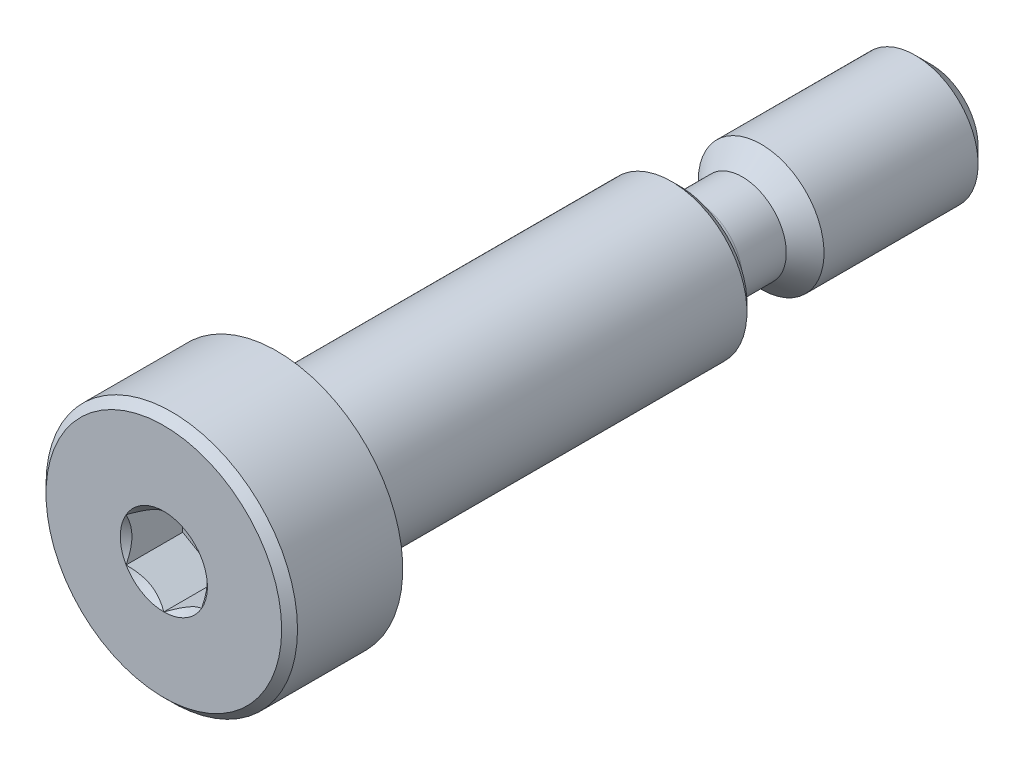
ISO-10303-21;
HEADER;
FILE_DESCRIPTION(('STEP AP214'),'2;1');
FILE_NAME('part.step','',(''),(''),'','','');
FILE_SCHEMA(('AUTOMOTIVE_DESIGN { 1 0 10303 214 1 1 1 1 }'));
ENDSEC;
DATA;
#1=APPLICATION_CONTEXT('core data for automotive mechanical design processes');
#2=APPLICATION_PROTOCOL_DEFINITION('international standard','automotive_design',2000,#1);
#3=PRODUCT_CONTEXT('',#1,'mechanical');
#4=PRODUCT('Part','Part','',(#3));
#5=PRODUCT_RELATED_PRODUCT_CATEGORY('part','',(#4));
#6=PRODUCT_DEFINITION_FORMATION('','',#4);
#7=PRODUCT_DEFINITION_CONTEXT('part definition',#1,'design');
#8=PRODUCT_DEFINITION('design','',#6,#7);
#9=PRODUCT_DEFINITION_SHAPE('','',#8);
#10=(LENGTH_UNIT() NAMED_UNIT(*) SI_UNIT(.MILLI.,.METRE.));
#11=(NAMED_UNIT(*) PLANE_ANGLE_UNIT() SI_UNIT($,.RADIAN.));
#12=(NAMED_UNIT(*) SI_UNIT($,.STERADIAN.) SOLID_ANGLE_UNIT());
#13=UNCERTAINTY_MEASURE_WITH_UNIT(LENGTH_MEASURE(1.E-05),#10,'distance_accuracy_value','');
#14=(GEOMETRIC_REPRESENTATION_CONTEXT(3) GLOBAL_UNCERTAINTY_ASSIGNED_CONTEXT((#13)) GLOBAL_UNIT_ASSIGNED_CONTEXT((#10,
#11,#12)) REPRESENTATION_CONTEXT('',''));
#15=CARTESIAN_POINT('',(0.,0.,0.));
#16=DIRECTION('',(0.,0.,1.));
#17=DIRECTION('',(1.,0.,0.));
#18=AXIS2_PLACEMENT_3D('',#15,#16,#17);
#19=CARTESIAN_POINT('',(0.,0.,0.));
#20=DIRECTION('',(0.,0.,1.));
#21=DIRECTION('',(1.,0.,0.));
#22=AXIS2_PLACEMENT_3D('',#19,#20,#21);
#23=PLANE('',#22);
#24=CARTESIAN_POINT('',(0.,0.,0.));
#25=DIRECTION('',(0.,0.,1.));
#26=DIRECTION('',(1.,0.,0.));
#27=AXIS2_PLACEMENT_3D('',#24,#25,#26);
#28=CIRCLE('',#27,1.73205080756888);
#29=CARTESIAN_POINT('',(1.5,0.866025403784439,0.));
#30=VERTEX_POINT('',#29);
#31=CARTESIAN_POINT('',(0.,1.73205080756888,0.));
#32=VERTEX_POINT('',#31);
#33=EDGE_CURVE('E105',#30,#32,#28,.T.);
#34=ORIENTED_EDGE('',*,*,#33,.F.);
#35=CARTESIAN_POINT('',(1.5,-0.866025403784438,0.));
#36=VERTEX_POINT('',#35);
#37=EDGE_CURVE('E94',#36,#30,#28,.T.);
#38=ORIENTED_EDGE('',*,*,#37,.F.);
#39=CARTESIAN_POINT('',(0.,-1.73205080756888,0.));
#40=VERTEX_POINT('',#39);
#41=EDGE_CURVE('E103',#40,#36,#28,.T.);
#42=ORIENTED_EDGE('',*,*,#41,.F.);
#43=CARTESIAN_POINT('',(-1.5,-0.86602540378444,0.));
#44=VERTEX_POINT('',#43);
#45=EDGE_CURVE('E54',#44,#40,#28,.T.);
#46=ORIENTED_EDGE('',*,*,#45,.F.);
#47=CARTESIAN_POINT('',(-1.5,0.86602540378444,0.));
#48=VERTEX_POINT('',#47);
#49=EDGE_CURVE('E61',#48,#44,#28,.T.);
#50=ORIENTED_EDGE('',*,*,#49,.F.);
#51=EDGE_CURVE('E131',#32,#48,#28,.T.);
#52=ORIENTED_EDGE('',*,*,#51,.F.);
#53=EDGE_LOOP('',(#34,#38,#42,#46,#50,#52));
#54=FACE_BOUND('',#53,.T.);
#55=CARTESIAN_POINT('',(0.,0.,0.));
#56=DIRECTION('',(0.,0.,1.));
#57=DIRECTION('',(1.,0.,0.));
#58=AXIS2_PLACEMENT_3D('',#55,#56,#57);
#59=CIRCLE('',#58,4.68499999999999);
#60=CARTESIAN_POINT('',(4.68499999999999,0.,0.));
#61=VERTEX_POINT('',#60);
#62=EDGE_CURVE('E48',#61,#61,#59,.T.);
#63=ORIENTED_EDGE('',*,*,#62,.T.);
#64=EDGE_LOOP('',(#63));
#65=FACE_BOUND('',#64,.T.);
#66=ADVANCED_FACE('F34',(#54,#65),#23,.T.);
#67=CARTESIAN_POINT('',(0.,0.,-30.5));
#68=DIRECTION('',(0.,0.,-1.));
#69=DIRECTION('',(-1.,0.,0.));
#70=AXIS2_PLACEMENT_3D('',#67,#68,#69);
#71=CYLINDRICAL_SURFACE('',#70,4.99999999999999);
#72=CARTESIAN_POINT('',(0.,0.,-0.315000000000003));
#73=DIRECTION('',(0.,0.,1.));
#74=DIRECTION('',(1.,0.,0.));
#75=AXIS2_PLACEMENT_3D('',#72,#73,#74);
#76=CIRCLE('',#75,4.99999999999999);
#77=CARTESIAN_POINT('',(4.99999999999999,0.,-0.315000000000003));
#78=VERTEX_POINT('',#77);
#79=EDGE_CURVE('E227',#78,#78,#76,.F.);
#80=ORIENTED_EDGE('',*,*,#79,.T.);
#81=EDGE_LOOP('',(#80));
#82=FACE_BOUND('',#81,.T.);
#83=CARTESIAN_POINT('',(0.,0.,-4.5));
#84=DIRECTION('',(0.,0.,-1.));
#85=DIRECTION('',(-1.,0.,0.));
#86=AXIS2_PLACEMENT_3D('',#83,#84,#85);
#87=CIRCLE('',#86,4.99999999999999);
#88=CARTESIAN_POINT('',(-4.99999999999999,0.,-4.5));
#89=VERTEX_POINT('',#88);
#90=EDGE_CURVE('E242',#89,#89,#87,.T.);
#91=ORIENTED_EDGE('',*,*,#90,.F.);
#92=EDGE_LOOP('',(#91));
#93=FACE_BOUND('',#92,.T.);
#94=ADVANCED_FACE('F196',(#82,#93),#71,.T.);
#95=CARTESIAN_POINT('',(0.,-4.99999999999999,-4.5));
#96=DIRECTION('',(0.,0.,-1.));
#97=DIRECTION('',(-1.,0.,0.));
#98=AXIS2_PLACEMENT_3D('',#95,#96,#97);
#99=PLANE('',#98);
#100=ORIENTED_EDGE('',*,*,#90,.T.);
#101=EDGE_LOOP('',(#100));
#102=FACE_BOUND('',#101,.T.);
#103=CARTESIAN_POINT('',(0.,0.,-4.5));
#104=DIRECTION('',(0.,0.,-1.));
#105=DIRECTION('',(-1.,0.,0.));
#106=AXIS2_PLACEMENT_3D('',#103,#104,#105);
#107=CIRCLE('',#106,3.);
#108=CARTESIAN_POINT('',(-3.,0.,-4.5));
#109=VERTEX_POINT('',#108);
#110=EDGE_CURVE('E244',#109,#109,#107,.T.);
#111=ORIENTED_EDGE('',*,*,#110,.F.);
#112=EDGE_LOOP('',(#111));
#113=FACE_BOUND('',#112,.T.);
#114=ADVANCED_FACE('F201',(#102,#113),#99,.T.);
#115=CARTESIAN_POINT('',(0.,0.,-30.5));
#116=DIRECTION('',(0.,0.,-1.));
#117=DIRECTION('',(-1.,0.,0.));
#118=AXIS2_PLACEMENT_3D('',#115,#116,#117);
#119=CYLINDRICAL_SURFACE('',#118,3.);
#120=CARTESIAN_POINT('',(0.,0.,-20.185));
#121=DIRECTION('',(0.,0.,-1.));
#122=DIRECTION('',(-1.,0.,0.));
#123=AXIS2_PLACEMENT_3D('',#120,#121,#122);
#124=CIRCLE('',#123,3.);
#125=CARTESIAN_POINT('',(-3.,0.,-20.185));
#126=VERTEX_POINT('',#125);
#127=EDGE_CURVE('E220',#126,#126,#124,.F.);
#128=ORIENTED_EDGE('',*,*,#127,.T.);
#129=EDGE_LOOP('',(#128));
#130=FACE_BOUND('',#129,.T.);
#131=ORIENTED_EDGE('',*,*,#110,.T.);
#132=EDGE_LOOP('',(#131));
#133=FACE_BOUND('',#132,.T.);
#134=ADVANCED_FACE('F344',(#130,#133),#119,.T.);
#135=CARTESIAN_POINT('',(0.,-3.,-20.5));
#136=DIRECTION('',(0.,0.,-1.));
#137=DIRECTION('',(-1.,0.,0.));
#138=AXIS2_PLACEMENT_3D('',#135,#136,#137);
#139=PLANE('',#138);
#140=CARTESIAN_POINT('',(0.,0.,-20.5));
#141=DIRECTION('',(0.,0.,-1.));
#142=DIRECTION('',(-1.,0.,0.));
#143=AXIS2_PLACEMENT_3D('',#140,#141,#142);
#144=CIRCLE('',#143,2.68499999999999);
#145=CARTESIAN_POINT('',(-2.68499999999999,0.,-20.5));
#146=VERTEX_POINT('',#145);
#147=EDGE_CURVE('E223',#146,#146,#144,.T.);
#148=ORIENTED_EDGE('',*,*,#147,.T.);
#149=EDGE_LOOP('',(#148));
#150=FACE_BOUND('',#149,.T.);
#151=CARTESIAN_POINT('',(0.,0.,-20.5));
#152=DIRECTION('',(0.,0.,-1.));
#153=DIRECTION('',(-1.,0.,0.));
#154=AXIS2_PLACEMENT_3D('',#151,#152,#153);
#155=CIRCLE('',#154,2.5);
#156=CARTESIAN_POINT('',(-2.5,0.,-20.5));
#157=VERTEX_POINT('',#156);
#158=EDGE_CURVE('E253',#157,#157,#155,.T.);
#159=ORIENTED_EDGE('',*,*,#158,.F.);
#160=EDGE_LOOP('',(#159));
#161=FACE_BOUND('',#160,.T.);
#162=ADVANCED_FACE('F351',(#150,#161),#139,.T.);
#163=CARTESIAN_POINT('',(0.,0.,-21.2500000075));
#164=DIRECTION('',(0.,0.,-1.));
#165=DIRECTION('',(-1.,0.,0.));
#166=AXIS2_PLACEMENT_3D('',#163,#164,#165);
#167=TOROIDAL_SURFACE('',#166,2.5,0.750000007499999);
#168=CARTESIAN_POINT('',(0.,0.,-21.2500000075));
#169=DIRECTION('',(0.,0.,-1.));
#170=DIRECTION('',(-1.,0.,0.));
#171=AXIS2_PLACEMENT_3D('',#168,#169,#170);
#172=CIRCLE('',#171,1.7499999925);
#173=CARTESIAN_POINT('',(-1.7499999925,0.,-21.2500000075));
#174=VERTEX_POINT('',#173);
#175=EDGE_CURVE('E257',#174,#174,#172,.T.);
#176=ORIENTED_EDGE('',*,*,#175,.F.);
#177=EDGE_LOOP('',(#176));
#178=FACE_BOUND('',#177,.T.);
#179=ORIENTED_EDGE('',*,*,#158,.T.);
#180=EDGE_LOOP('',(#179));
#181=FACE_BOUND('',#180,.T.);
#182=ADVANCED_FACE('F359',(#178,#181),#167,.F.);
#183=CARTESIAN_POINT('',(0.,0.,-30.5));
#184=DIRECTION('',(0.,0.,-1.));
#185=DIRECTION('',(-1.,0.,0.));
#186=AXIS2_PLACEMENT_3D('',#183,#184,#185);
#187=CYLINDRICAL_SURFACE('',#186,1.7499999925);
#188=CARTESIAN_POINT('',(0.,0.,-23.));
#189=DIRECTION('',(0.,0.,-1.));
#190=DIRECTION('',(-1.,0.,0.));
#191=AXIS2_PLACEMENT_3D('',#188,#189,#190);
#192=CIRCLE('',#191,1.7499999925);
#193=CARTESIAN_POINT('',(-1.7499999925,0.,-23.));
#194=VERTEX_POINT('',#193);
#195=EDGE_CURVE('E261',#194,#194,#192,.T.);
#196=ORIENTED_EDGE('',*,*,#195,.F.);
#197=EDGE_LOOP('',(#196));
#198=FACE_BOUND('',#197,.T.);
#199=ORIENTED_EDGE('',*,*,#175,.T.);
#200=EDGE_LOOP('',(#199));
#201=FACE_BOUND('',#200,.T.);
#202=ADVANCED_FACE('F385',(#198,#201),#187,.T.);
#203=CARTESIAN_POINT('',(0.,0.,-23.));
#204=DIRECTION('',(0.,0.,-1.));
#205=DIRECTION('',(-1.,0.,0.));
#206=AXIS2_PLACEMENT_3D('',#203,#204,#205);
#207=CONICAL_SURFACE('',#206,1.7499999925,0.785398163397444);
#208=CARTESIAN_POINT('',(0.,0.,-23.7500000075));
#209=DIRECTION('',(0.,0.,-1.));
#210=DIRECTION('',(-1.,0.,0.));
#211=AXIS2_PLACEMENT_3D('',#208,#209,#210);
#212=CIRCLE('',#211,2.5);
#213=CARTESIAN_POINT('',(-2.5,0.,-23.7500000075));
#214=VERTEX_POINT('',#213);
#215=EDGE_CURVE('E248',#214,#214,#212,.F.);
#216=ORIENTED_EDGE('',*,*,#215,.T.);
#217=EDGE_LOOP('',(#216));
#218=FACE_BOUND('',#217,.T.);
#219=ORIENTED_EDGE('',*,*,#195,.T.);
#220=EDGE_LOOP('',(#219));
#221=FACE_BOUND('',#220,.T.);
#222=ADVANCED_FACE('F376',(#218,#221),#207,.T.);
#223=CARTESIAN_POINT('',(0.,-2.5,-30.5));
#224=DIRECTION('',(0.,0.,-1.));
#225=DIRECTION('',(-1.,0.,0.));
#226=AXIS2_PLACEMENT_3D('',#223,#224,#225);
#227=PLANE('',#226);
#228=CARTESIAN_POINT('',(0.,0.,-30.5));
#229=DIRECTION('',(0.,0.,-1.));
#230=DIRECTION('',(-1.,0.,0.));
#231=AXIS2_PLACEMENT_3D('',#228,#229,#230);
#232=CIRCLE('',#231,1.875);
#233=CARTESIAN_POINT('',(-1.875,0.,-30.5));
#234=VERTEX_POINT('',#233);
#235=EDGE_CURVE('E230',#234,#234,#232,.T.);
#236=ORIENTED_EDGE('',*,*,#235,.T.);
#237=EDGE_LOOP('',(#236));
#238=FACE_BOUND('',#237,.T.);
#239=ADVANCED_FACE('F367',(#238),#227,.T.);
#240=CARTESIAN_POINT('',(0.,0.,-30.5));
#241=DIRECTION('',(0.,0.,-1.));
#242=DIRECTION('',(-1.,0.,0.));
#243=AXIS2_PLACEMENT_3D('',#240,#241,#242);
#244=CYLINDRICAL_SURFACE('',#243,2.5);
#245=CARTESIAN_POINT('',(0.,0.,-29.875));
#246=DIRECTION('',(0.,0.,-1.));
#247=DIRECTION('',(-1.,0.,0.));
#248=AXIS2_PLACEMENT_3D('',#245,#246,#247);
#249=CIRCLE('',#248,2.5);
#250=CARTESIAN_POINT('',(-2.5,0.,-29.875));
#251=VERTEX_POINT('',#250);
#252=EDGE_CURVE('E225',#251,#251,#249,.F.);
#253=ORIENTED_EDGE('',*,*,#252,.T.);
#254=EDGE_LOOP('',(#253));
#255=FACE_BOUND('',#254,.T.);
#256=ORIENTED_EDGE('',*,*,#215,.F.);
#257=EDGE_LOOP('',(#256));
#258=FACE_BOUND('',#257,.T.);
#259=ADVANCED_FACE('F209',(#255,#258),#244,.T.);
#260=CARTESIAN_POINT('',(0.,0.,-30.5));
#261=DIRECTION('',(0.,0.,1.));
#262=DIRECTION('',(1.,0.,0.));
#263=AXIS2_PLACEMENT_3D('',#260,#261,#262);
#264=CONICAL_SURFACE('',#263,1.875,0.785398163397453);
#265=ORIENTED_EDGE('',*,*,#252,.F.);
#266=EDGE_LOOP('',(#265));
#267=FACE_BOUND('',#266,.T.);
#268=ORIENTED_EDGE('',*,*,#235,.F.);
#269=EDGE_LOOP('',(#268));
#270=FACE_BOUND('',#269,.T.);
#271=ADVANCED_FACE('F206',(#267,#270),#264,.T.);
#272=CARTESIAN_POINT('',(0.,0.,-20.5));
#273=DIRECTION('',(0.,0.,1.));
#274=DIRECTION('',(1.,0.,0.));
#275=AXIS2_PLACEMENT_3D('',#272,#273,#274);
#276=CONICAL_SURFACE('',#275,2.68499999999999,0.785398163397452);
#277=ORIENTED_EDGE('',*,*,#127,.F.);
#278=EDGE_LOOP('',(#277));
#279=FACE_BOUND('',#278,.T.);
#280=ORIENTED_EDGE('',*,*,#147,.F.);
#281=EDGE_LOOP('',(#280));
#282=FACE_BOUND('',#281,.T.);
#283=ADVANCED_FACE('F208',(#279,#282),#276,.T.);
#284=CARTESIAN_POINT('',(0.,0.,-0.315000000000003));
#285=DIRECTION('',(0.,0.,-1.));
#286=DIRECTION('',(-1.,0.,0.));
#287=AXIS2_PLACEMENT_3D('',#284,#285,#286);
#288=CONICAL_SURFACE('',#287,4.99999999999999,0.785398163397451);
#289=ORIENTED_EDGE('',*,*,#62,.F.);
#290=EDGE_LOOP('',(#289));
#291=FACE_BOUND('',#290,.T.);
#292=ORIENTED_EDGE('',*,*,#79,.F.);
#293=EDGE_LOOP('',(#292));
#294=FACE_BOUND('',#293,.T.);
#295=ADVANCED_FACE('F36',(#291,#294),#288,.T.);
#296=CARTESIAN_POINT('',(0.,0.,0.));
#297=DIRECTION('',(0.,0.,1.));
#298=DIRECTION('',(1.,0.,0.));
#299=AXIS2_PLACEMENT_3D('',#296,#297,#298);
#300=CONICAL_SURFACE('',#299,1.73205080756888,0.78539816339745);
#301=ORIENTED_EDGE('',*,*,#33,.T.);
#302=CARTESIAN_POINT('',(1.5002,0.865909933730602,0.000115481600072925));
#303=CARTESIAN_POINT('',(1.44863220926292,0.895682611594167,-0.0296345239326727));
#304=CARTESIAN_POINT('',(1.3962020823348,0.925953159489766,-0.0576375160896877));
#305=CARTESIAN_POINT('',(1.2892909659444,0.987678321317124,-0.108910769559858));
#306=CARTESIAN_POINT('',(1.23479980418534,1.01913880822718,-0.132152494955627));
#307=CARTESIAN_POINT('',(1.12492091864275,1.08257741237344,-0.17196627100778));
#308=CARTESIAN_POINT('',(1.0695611909048,1.11453936608521,-0.188638414329104));
#309=CARTESIAN_POINT('',(0.95762274252285,1.1791670593912,-0.214325543181897));
#310=CARTESIAN_POINT('',(0.901047443446992,1.21183082354213,-0.223359709521134));
#311=CARTESIAN_POINT('',(0.80354461048356,1.26812411040032,-0.231510918773148));
#312=CARTESIAN_POINT('',(0.762743091719534,1.29168087824208,-0.232717747010783));
#313=CARTESIAN_POINT('',(0.681212030384142,1.33875285845138,-0.230685942837733));
#314=CARTESIAN_POINT('',(0.64048250568537,1.36226806050018,-0.227446329251692));
#315=CARTESIAN_POINT('',(0.559415597836584,1.40907206156905,-0.216708014018038));
#316=CARTESIAN_POINT('',(0.519078615401712,1.43236062923612,-0.209205346981267));
#317=CARTESIAN_POINT('',(0.43908166308597,1.47854689118997,-0.19034838807171));
#318=CARTESIAN_POINT('',(0.399421991483792,1.50144441326545,-0.178992442981415));
#319=CARTESIAN_POINT('',(0.297836865225515,1.56009461325633,-0.145278352407328));
#320=CARTESIAN_POINT('',(0.236541446290311,1.59548353987866,-0.120378150906633));
#321=CARTESIAN_POINT('',(0.146414371536687,1.64751843074894,-0.0783433467284236));
#322=CARTESIAN_POINT('',(0.116714860092282,1.66466545167617,-0.0635748464409038));
#323=CARTESIAN_POINT('',(0.0578620986162492,1.69864410935691,-0.0326894340598312));
#324=CARTESIAN_POINT('',(0.028708595779363,1.71547589206761,-0.0165731658782895));
#325=CARTESIAN_POINT('',(-0.000199999999999705,1.73216627762272,0.000115481600073648));
#326=B_SPLINE_CURVE_WITH_KNOTS('',3,(#302,#303,#304,#305,#306,#307,#308,#309,#310,#311,#312,
#313,#314,#315,#316,#317,#318,#319,#320,#321,#322,#323,#324,#325),.UNSPECIFIED.,.F.,.F.,(4,2,2,
2,2,2,2,2,2,2,2,4),(0.,0.199829143693305,0.400822987382388,0.59862372053818,0.795926240188889,
0.937113067959881,1.07833105577193,1.21968061668222,1.36109089931054,1.58570969637565,
1.69770705470964,1.80965120737194),.UNSPECIFIED.);
#327=EDGE_CURVE('E11',#30,#32,#326,.T.);
#328=ORIENTED_EDGE('',*,*,#327,.F.);
#329=EDGE_LOOP('',(#301,#328));
#330=FACE_BOUND('',#329,.T.);
#331=ADVANCED_FACE('F108',(#330),#300,.F.);
#332=ORIENTED_EDGE('',*,*,#51,.T.);
#333=CARTESIAN_POINT('',(0.000200000000000363,1.73216627762272,0.000115481600073445));
#334=CARTESIAN_POINT('',(-0.0513677907370753,1.70239359975915,-0.0296345239326722));
#335=CARTESIAN_POINT('',(-0.103797917665201,1.67212305186355,-0.0576375160896873));
#336=CARTESIAN_POINT('',(-0.210709034055596,1.61039789003619,-0.108910769559857));
#337=CARTESIAN_POINT('',(-0.265200195814661,1.57893740312614,-0.132152494955627));
#338=CARTESIAN_POINT('',(-0.375079081357248,1.51549879897987,-0.17196627100778));
#339=CARTESIAN_POINT('',(-0.430438809095199,1.4835368452681,-0.188638414329104));
#340=CARTESIAN_POINT('',(-0.54237725747715,1.41890915196211,-0.214325543181897));
#341=CARTESIAN_POINT('',(-0.598952556553008,1.38624538781118,-0.223359709521134));
#342=CARTESIAN_POINT('',(-0.696455389516441,1.329952100953,-0.231510918773148));
#343=CARTESIAN_POINT('',(-0.737256908280466,1.30639533311124,-0.232717747010783));
#344=CARTESIAN_POINT('',(-0.818787969615858,1.25932335290194,-0.230685942837733));
#345=CARTESIAN_POINT('',(-0.85951749431463,1.23580815085313,-0.227446329251692));
#346=CARTESIAN_POINT('',(-0.940584402163416,1.18900414978427,-0.216708014018038));
#347=CARTESIAN_POINT('',(-0.980921384598288,1.1657155821172,-0.209205346981267));
#348=CARTESIAN_POINT('',(-1.06091833691403,1.11952932016335,-0.19034838807171));
#349=CARTESIAN_POINT('',(-1.10057800851621,1.09663179808786,-0.178992442981415));
#350=CARTESIAN_POINT('',(-1.20216313477449,1.03798159809699,-0.145278352407328));
#351=CARTESIAN_POINT('',(-1.26345855370969,1.00259267147465,-0.120378150906633));
#352=CARTESIAN_POINT('',(-1.35358562846331,0.950557780604376,-0.078343346728424));
#353=CARTESIAN_POINT('',(-1.38328513990772,0.933410759677148,-0.0635748464409041));
#354=CARTESIAN_POINT('',(-1.44213790138375,0.899432101996408,-0.0326894340598316));
#355=CARTESIAN_POINT('',(-1.47129140422064,0.882600319285711,-0.0165731658782899));
#356=CARTESIAN_POINT('',(-1.5002,0.865909933730602,0.000115481600073083));
#357=B_SPLINE_CURVE_WITH_KNOTS('',3,(#333,#334,#335,#336,#337,#338,#339,#340,#341,#342,#343,
#344,#345,#346,#347,#348,#349,#350,#351,#352,#353,#354,#355,#356),.UNSPECIFIED.,.F.,.F.,(4,2,2,
2,2,2,2,2,2,2,2,4),(0.,0.199829143693305,0.400822987382389,0.598623720538181,0.795926240188889,
0.937113067959881,1.07833105577193,1.21968061668222,1.36109089931054,1.58570969637565,
1.69770705470964,1.80965120737194),.UNSPECIFIED.);
#358=EDGE_CURVE('E132',#32,#48,#357,.T.);
#359=ORIENTED_EDGE('',*,*,#358,.F.);
#360=EDGE_LOOP('',(#332,#359));
#361=FACE_BOUND('',#360,.T.);
#362=ADVANCED_FACE('F297',(#361),#300,.F.);
#363=ORIENTED_EDGE('',*,*,#49,.T.);
#364=CARTESIAN_POINT('',(-1.5,-1.72720812994822,0.555578516460526));
#365=CARTESIAN_POINT('',(-1.5,-1.68515175723693,0.523829908039853));
#366=CARTESIAN_POINT('',(-1.5,-1.64286104772391,0.492392593982514));
#367=CARTESIAN_POINT('',(-1.5,-1.55771581058238,0.430269087716989));
#368=CARTESIAN_POINT('',(-1.5,-1.51486114408249,0.399583086045528));
#369=CARTESIAN_POINT('',(-1.5,-1.38468134170665,0.308407192558586));
#370=CARTESIAN_POINT('',(-1.5,-1.29637976089561,0.24928834354366));
#371=CARTESIAN_POINT('',(-1.5,-1.11121478745132,0.133230996403485));
#372=CARTESIAN_POINT('',(-1.5,-1.01415038251067,0.0766095588047322));
#373=CARTESIAN_POINT('',(-1.5,-0.815173408989814,-0.0269631186909066));
#374=CARTESIAN_POINT('',(-1.5,-0.71327866932636,-0.0739469584279363));
#375=CARTESIAN_POINT('',(-1.5,-0.56033377500179,-0.131427331548459));
#376=CARTESIAN_POINT('',(-1.5,-0.511547983012749,-0.147924612221662));
#377=CARTESIAN_POINT('',(-1.5,-0.412798620213828,-0.177002487052371));
#378=CARTESIAN_POINT('',(-1.5,-0.36283496852075,-0.189582811386199));
#379=CARTESIAN_POINT('',(-1.5,-0.262863235540417,-0.209963805836544));
#380=CARTESIAN_POINT('',(-1.5,-0.212872113909475,-0.217846367239551));
#381=CARTESIAN_POINT('',(-1.5,-0.112355243682832,-0.228677936022323));
#382=CARTESIAN_POINT('',(-1.5,-0.0618295884917308,-0.231627791470553));
#383=CARTESIAN_POINT('',(-1.5,0.0374291732025498,-0.232375142278223));
#384=CARTESIAN_POINT('',(-1.5,0.0861609670655346,-0.230355266449521));
#385=CARTESIAN_POINT('',(-1.5,0.183206937624695,-0.221677447120588));
#386=CARTESIAN_POINT('',(-1.5,0.231521073289701,-0.215019053054118));
#387=CARTESIAN_POINT('',(-1.5,0.328199853268109,-0.197314755910964));
#388=CARTESIAN_POINT('',(-1.5,0.376550616148692,-0.186194188782255));
#389=CARTESIAN_POINT('',(-1.5,0.472195696955761,-0.160156586002234));
#390=CARTESIAN_POINT('',(-1.5,0.51949010291901,-0.145239868015899));
#391=CARTESIAN_POINT('',(-1.5,0.668391282485064,-0.0926647764885243));
#392=CARTESIAN_POINT('',(-1.5,0.767878709264952,-0.0490187126381638));
#393=CARTESIAN_POINT('',(-1.5,0.962179866385501,0.048022994429059));
#394=CARTESIAN_POINT('',(-1.5,1.05697519927965,0.101453664897119));
#395=CARTESIAN_POINT('',(-1.5,1.23814273494588,0.211685851757829));
#396=CARTESIAN_POINT('',(-1.5,1.32469942140117,0.268187920426179));
#397=CARTESIAN_POINT('',(-1.5,1.45222331245985,0.355534301267842));
#398=CARTESIAN_POINT('',(-1.5,1.49418091932912,0.384957758356527));
#399=CARTESIAN_POINT('',(-1.5,1.5775227288333,0.444582821481567));
#400=CARTESIAN_POINT('',(-1.5,1.6189070859806,0.474784211302858));
#401=CARTESIAN_POINT('',(-1.5,1.66005277969054,0.505308178235209));
#402=B_SPLINE_CURVE_WITH_KNOTS('',3,(#364,#365,#366,#367,#368,#369,#370,#371,#372,#373,#374,
#375,#376,#377,#378,#379,#380,#381,#382,#383,#384,#385,#386,#387,#388,#389,#390,#391,#392,#393,
#394,#395,#396,#397,#398,#399,#400,#401),.UNSPECIFIED.,.F.,.F.,(4,2,2,2,2,2,2,2,2,2,2,2,2,2,2,2,
2,2,4),(0.,0.158079549012758,0.316198781054129,0.634850417468465,0.971690311551782,
1.30737131686505,1.46173961151184,1.61611853763032,1.76772101442095,1.91929742387554,
2.06538741227089,2.21149159321503,2.36014984648185,2.50879566399376,2.83376031423511,
3.15991186974583,3.4698560178094,3.62358896013692,3.77727962610764),.UNSPECIFIED.);
#403=EDGE_CURVE('E134',#48,#44,#402,.F.);
#404=ORIENTED_EDGE('',*,*,#403,.F.);
#405=EDGE_LOOP('',(#363,#404));
#406=FACE_BOUND('',#405,.T.);
#407=ADVANCED_FACE('F294',(#406),#300,.F.);
#408=ORIENTED_EDGE('',*,*,#45,.T.);
#409=CARTESIAN_POINT('',(-1.5002,-0.8659099337306,0.000115481600072274));
#410=CARTESIAN_POINT('',(-1.44863220926292,-0.895682611594165,-0.0296345239326734));
#411=CARTESIAN_POINT('',(-1.3962020823348,-0.925953159489764,-0.0576375160896886));
#412=CARTESIAN_POINT('',(-1.2892909659444,-0.987678321317123,-0.108910769559859));
#413=CARTESIAN_POINT('',(-1.23479980418534,-1.01913880822717,-0.132152494955628));
#414=CARTESIAN_POINT('',(-1.12492091864275,-1.08257741237344,-0.171966271007781));
#415=CARTESIAN_POINT('',(-1.0695611909048,-1.11453936608521,-0.188638414329105));
#416=CARTESIAN_POINT('',(-0.95762274252285,-1.1791670593912,-0.214325543181898));
#417=CARTESIAN_POINT('',(-0.901047443446992,-1.21183082354213,-0.223359709521136));
#418=CARTESIAN_POINT('',(-0.80354461048356,-1.26812411040032,-0.23151091877315));
#419=CARTESIAN_POINT('',(-0.762743091719534,-1.29168087824208,-0.232717747010785));
#420=CARTESIAN_POINT('',(-0.681212030384142,-1.33875285845138,-0.230685942837734));
#421=CARTESIAN_POINT('',(-0.640482505685371,-1.36226806050018,-0.227446329251694));
#422=CARTESIAN_POINT('',(-0.559415597836585,-1.40907206156905,-0.21670801401804));
#423=CARTESIAN_POINT('',(-0.519078615401713,-1.43236062923612,-0.209205346981268));
#424=CARTESIAN_POINT('',(-0.43908166308597,-1.47854689118996,-0.190348388071711));
#425=CARTESIAN_POINT('',(-0.399421991483793,-1.50144441326545,-0.178992442981417));
#426=CARTESIAN_POINT('',(-0.297836865225516,-1.56009461325633,-0.14527835240733));
#427=CARTESIAN_POINT('',(-0.236541446290311,-1.59548353987866,-0.120378150906635));
#428=CARTESIAN_POINT('',(-0.146414371536687,-1.64751843074894,-0.0783433467284256));
#429=CARTESIAN_POINT('',(-0.116714860092283,-1.66466545167617,-0.0635748464409056));
#430=CARTESIAN_POINT('',(-0.0578620986162493,-1.69864410935691,-0.0326894340598329));
#431=CARTESIAN_POINT('',(-0.028708595779363,-1.71547589206761,-0.0165731658782912));
#432=CARTESIAN_POINT('',(0.00019999999999994,-1.73216627762271,0.000115481600071697));
#433=B_SPLINE_CURVE_WITH_KNOTS('',3,(#409,#410,#411,#412,#413,#414,#415,#416,#417,#418,#419,
#420,#421,#422,#423,#424,#425,#426,#427,#428,#429,#430,#431,#432),.UNSPECIFIED.,.F.,.F.,(4,2,2,
2,2,2,2,2,2,2,2,4),(0.,0.199829143693305,0.400822987382389,0.59862372053818,0.795926240188889,
0.93711306795988,1.07833105577193,1.21968061668222,1.36109089931054,1.58570969637565,
1.69770705470964,1.80965120737194),.UNSPECIFIED.);
#434=EDGE_CURVE('E161',#44,#40,#433,.T.);
#435=ORIENTED_EDGE('',*,*,#434,.F.);
#436=EDGE_LOOP('',(#408,#435));
#437=FACE_BOUND('',#436,.T.);
#438=ADVANCED_FACE('F303',(#437),#300,.F.);
#439=ORIENTED_EDGE('',*,*,#41,.T.);
#440=CARTESIAN_POINT('',(-0.000200000000000087,-1.73216627762271,0.000115481600071711));
#441=CARTESIAN_POINT('',(0.0513677907370756,-1.70239359975915,-0.0296345239326739));
#442=CARTESIAN_POINT('',(0.103797917665201,-1.67212305186355,-0.057637516089689));
#443=CARTESIAN_POINT('',(0.210709034055597,-1.61039789003619,-0.108910769559859));
#444=CARTESIAN_POINT('',(0.265200195814661,-1.57893740312614,-0.132152494955629));
#445=CARTESIAN_POINT('',(0.375079081357248,-1.51549879897987,-0.171966271007781));
#446=CARTESIAN_POINT('',(0.430438809095199,-1.4835368452681,-0.188638414329105));
#447=CARTESIAN_POINT('',(0.54237725747715,-1.41890915196211,-0.214325543181898));
#448=CARTESIAN_POINT('',(0.598952556553008,-1.38624538781118,-0.223359709521135));
#449=CARTESIAN_POINT('',(0.69645538951644,-1.32995210095299,-0.231510918773149));
#450=CARTESIAN_POINT('',(0.737256908280466,-1.30639533311124,-0.232717747010785));
#451=CARTESIAN_POINT('',(0.818787969615858,-1.25932335290193,-0.230685942837734));
#452=CARTESIAN_POINT('',(0.859517494314629,-1.23580815085313,-0.227446329251694));
#453=CARTESIAN_POINT('',(0.940584402163415,-1.18900414978427,-0.216708014018039));
#454=CARTESIAN_POINT('',(0.980921384598287,-1.1657155821172,-0.209205346981268));
#455=CARTESIAN_POINT('',(1.06091833691403,-1.11952932016335,-0.190348388071711));
#456=CARTESIAN_POINT('',(1.10057800851621,-1.09663179808786,-0.178992442981416));
#457=CARTESIAN_POINT('',(1.20216313477448,-1.03798159809698,-0.14527835240733));
#458=CARTESIAN_POINT('',(1.26345855370969,-1.00259267147465,-0.120378150906634));
#459=CARTESIAN_POINT('',(1.35358562846331,-0.950557780604374,-0.0783433467284251));
#460=CARTESIAN_POINT('',(1.38328513990772,-0.933410759677147,-0.0635748464409052));
#461=CARTESIAN_POINT('',(1.44213790138375,-0.899432101996406,-0.0326894340598326));
#462=CARTESIAN_POINT('',(1.47129140422064,-0.88260031928571,-0.0165731658782908));
#463=CARTESIAN_POINT('',(1.5002,-0.865909933730601,0.000115481600072265));
#464=B_SPLINE_CURVE_WITH_KNOTS('',3,(#440,#441,#442,#443,#444,#445,#446,#447,#448,#449,#450,
#451,#452,#453,#454,#455,#456,#457,#458,#459,#460,#461,#462,#463),.UNSPECIFIED.,.F.,.F.,(4,2,2,
2,2,2,2,2,2,2,2,4),(0.,0.199829143693305,0.400822987382388,0.59862372053818,0.795926240188889,
0.93711306795988,1.07833105577193,1.21968061668222,1.36109089931054,1.58570969637565,
1.69770705470964,1.80965120737194),.UNSPECIFIED.);
#465=EDGE_CURVE('E120',#40,#36,#464,.T.);
#466=ORIENTED_EDGE('',*,*,#465,.F.);
#467=EDGE_LOOP('',(#439,#466));
#468=FACE_BOUND('',#467,.T.);
#469=ADVANCED_FACE('F154',(#468),#300,.F.);
#470=ORIENTED_EDGE('',*,*,#37,.T.);
#471=CARTESIAN_POINT('',(1.5,-1.72720812969693,0.555578516270791));
#472=CARTESIAN_POINT('',(1.5,-1.68515175699268,0.523829907857426));
#473=CARTESIAN_POINT('',(1.5,-1.64286104748674,0.492392593807383));
#474=CARTESIAN_POINT('',(1.5,-1.55771581035942,0.430269087556409));
#475=CARTESIAN_POINT('',(1.5,-1.51486114386668,0.399583085892201));
#476=CARTESIAN_POINT('',(1.5,-1.3846813415127,0.30840719242716));
#477=CARTESIAN_POINT('',(1.5,-1.29637976071654,0.249288343426772));
#478=CARTESIAN_POINT('',(1.5,-1.11121478730467,0.133230996316503));
#479=CARTESIAN_POINT('',(1.5,-1.01415038238167,0.0766095587330073));
#480=CARTESIAN_POINT('',(1.5,-0.815173408897606,-0.0269631187343477));
#481=CARTESIAN_POINT('',(1.5,-0.713278669253285,-0.0739469584583312));
#482=CARTESIAN_POINT('',(1.5,-0.560333774943112,-0.131427331569171));
#483=CARTESIAN_POINT('',(1.5,-0.511547982948042,-0.147924612242752));
#484=CARTESIAN_POINT('',(1.5,-0.412798620136866,-0.177002487072996));
#485=CARTESIAN_POINT('',(1.5,-0.362834968437562,-0.189582811405982));
#486=CARTESIAN_POINT('',(1.5,-0.262863235444982,-0.209963805853231));
#487=CARTESIAN_POINT('',(1.5,-0.212872113808022,-0.21784636725402));
#488=CARTESIAN_POINT('',(1.5,-0.112355243569545,-0.228677936030998));
#489=CARTESIAN_POINT('',(1.5,-0.0618295883726279,-0.23162779147565));
#490=CARTESIAN_POINT('',(1.5,0.037429173332384,-0.232375142275151));
#491=CARTESIAN_POINT('',(1.5,0.0861609672002989,-0.230355266441925));
#492=CARTESIAN_POINT('',(1.5,0.183206937768827,-0.221677447103242));
#493=CARTESIAN_POINT('',(1.5,0.231521073438269,-0.215019053031544));
#494=CARTESIAN_POINT('',(1.5,0.328199853425436,-0.197314755877433));
#495=CARTESIAN_POINT('',(1.5,0.376550616310328,-0.186194188742962));
#496=CARTESIAN_POINT('',(1.5,0.472195697125598,-0.160156585951289));
#497=CARTESIAN_POINT('',(1.5,0.51949010309274,-0.145239867959066));
#498=CARTESIAN_POINT('',(1.5,0.668391282696625,-0.0926647764039285));
#499=CARTESIAN_POINT('',(1.5,0.767878709508553,-0.0490187125280254));
#500=CARTESIAN_POINT('',(1.5,0.962179866690724,0.0480229945930965));
#501=CARTESIAN_POINT('',(1.5,1.05697519961444,0.101453665089533));
#502=CARTESIAN_POINT('',(1.5,1.23814273533383,0.211685852004557));
#503=CARTESIAN_POINT('',(1.5,1.3246994218129,0.268187920698595));
#504=CARTESIAN_POINT('',(1.5,1.45222331290673,0.355534301578659));
#505=CARTESIAN_POINT('',(1.5,1.49418091978756,0.384957758680043));
#506=CARTESIAN_POINT('',(1.5,1.57752272931476,0.444582821830463));
#507=CARTESIAN_POINT('',(1.5,1.61890708647354,0.474784211664437));
#508=CARTESIAN_POINT('',(1.5,1.66005278019494,0.505308178609455));
#509=B_SPLINE_CURVE_WITH_KNOTS('',3,(#471,#472,#473,#474,#475,#476,#477,#478,#479,#480,#481,
#482,#483,#484,#485,#486,#487,#488,#489,#490,#491,#492,#493,#494,#495,#496,#497,#498,#499,#500,
#501,#502,#503,#504,#505,#506,#507,#508),.UNSPECIFIED.,.F.,.F.,(4,2,2,2,2,2,2,2,2,2,2,2,2,2,2,2,
2,2,4),(0.,0.158079548982669,0.316198780993942,0.634850417346959,0.97169031136151,
1.30737131660667,1.46173961127089,1.61611853740677,1.7677210142141,1.91929742368538,
2.065387412096,2.21149159305544,2.36014984633872,2.50879566386709,2.83376031422673,
3.15991186985652,3.46985601802198,3.62358896039974,3.77727962642071),.UNSPECIFIED.);
#510=EDGE_CURVE('E98',#36,#30,#509,.T.);
#511=ORIENTED_EDGE('',*,*,#510,.F.);
#512=EDGE_LOOP('',(#470,#511));
#513=FACE_BOUND('',#512,.T.);
#514=ADVANCED_FACE('F96',(#513),#300,.F.);
#515=CARTESIAN_POINT('',(1.5,0.86602540378444,-2.25));
#516=DIRECTION('',(0.,0.,1.));
#517=DIRECTION('',(1.,0.,0.));
#518=AXIS2_PLACEMENT_3D('',#515,#516,#517);
#519=PLANE('',#518);
#520=DIRECTION('',(0.,1.,0.));
#521=VECTOR('',#520,1.);
#522=CARTESIAN_POINT('',(1.5,-0.866025403784438,-2.25));
#523=LINE('',#522,#521);
#524=CARTESIAN_POINT('',(1.5,-0.866025403784438,-2.25));
#525=VERTEX_POINT('',#524);
#526=CARTESIAN_POINT('',(1.5,0.86602540378444,-2.25));
#527=VERTEX_POINT('',#526);
#528=EDGE_CURVE('E119',#525,#527,#523,.T.);
#529=ORIENTED_EDGE('',*,*,#528,.T.);
#530=DIRECTION('',(-0.866025403784439,0.5,0.));
#531=VECTOR('',#530,1.);
#532=CARTESIAN_POINT('',(1.5,0.86602540378444,-2.25));
#533=LINE('',#532,#531);
#534=CARTESIAN_POINT('',(0.,1.73205080756888,-2.25));
#535=VERTEX_POINT('',#534);
#536=EDGE_CURVE('E124',#527,#535,#533,.T.);
#537=ORIENTED_EDGE('',*,*,#536,.T.);
#538=DIRECTION('',(-0.866025403784439,-0.5,0.));
#539=VECTOR('',#538,1.);
#540=CARTESIAN_POINT('',(0.,1.73205080756888,-2.25));
#541=LINE('',#540,#539);
#542=CARTESIAN_POINT('',(-1.5,0.86602540378444,-2.25));
#543=VERTEX_POINT('',#542);
#544=EDGE_CURVE('E284',#535,#543,#541,.T.);
#545=ORIENTED_EDGE('',*,*,#544,.T.);
#546=DIRECTION('',(0.,-1.,0.));
#547=VECTOR('',#546,1.);
#548=CARTESIAN_POINT('',(-1.5,0.86602540378444,-2.25));
#549=LINE('',#548,#547);
#550=CARTESIAN_POINT('',(-1.5,-0.866025403784438,-2.25));
#551=VERTEX_POINT('',#550);
#552=EDGE_CURVE('E281',#543,#551,#549,.T.);
#553=ORIENTED_EDGE('',*,*,#552,.T.);
#554=DIRECTION('',(0.866025403784439,-0.5,0.));
#555=VECTOR('',#554,1.);
#556=CARTESIAN_POINT('',(-1.5,-0.866025403784438,-2.25));
#557=LINE('',#556,#555);
#558=CARTESIAN_POINT('',(0.,-1.73205080756888,-2.25));
#559=VERTEX_POINT('',#558);
#560=EDGE_CURVE('E278',#551,#559,#557,.T.);
#561=ORIENTED_EDGE('',*,*,#560,.T.);
#562=DIRECTION('',(0.866025403784439,0.5,0.));
#563=VECTOR('',#562,1.);
#564=CARTESIAN_POINT('',(0.,-1.73205080756888,-2.25));
#565=LINE('',#564,#563);
#566=EDGE_CURVE('E127',#559,#525,#565,.T.);
#567=ORIENTED_EDGE('',*,*,#566,.T.);
#568=EDGE_LOOP('',(#529,#537,#545,#553,#561,#567));
#569=FACE_BOUND('',#568,.T.);
#570=ADVANCED_FACE('F153',(#569),#519,.T.);
#571=CARTESIAN_POINT('',(1.5,0.86602540378444,-2.25));
#572=DIRECTION('',(0.5,0.866025403784439,0.));
#573=DIRECTION('',(-0.866025403784439,0.5,0.));
#574=AXIS2_PLACEMENT_3D('',#571,#572,#573);
#575=PLANE('',#574);
#576=DIRECTION('',(0.,0.,1.));
#577=VECTOR('',#576,1.);
#578=CARTESIAN_POINT('',(1.5,0.86602540378444,-2.25));
#579=LINE('',#578,#577);
#580=EDGE_CURVE('E115',#527,#30,#579,.T.);
#581=ORIENTED_EDGE('',*,*,#580,.T.);
#582=ORIENTED_EDGE('',*,*,#327,.T.);
#583=DIRECTION('',(0.,0.,1.));
#584=VECTOR('',#583,1.);
#585=CARTESIAN_POINT('',(0.,1.73205080756888,-2.25));
#586=LINE('',#585,#584);
#587=EDGE_CURVE('E126',#535,#32,#586,.T.);
#588=ORIENTED_EDGE('',*,*,#587,.F.);
#589=ORIENTED_EDGE('',*,*,#536,.F.);
#590=EDGE_LOOP('',(#581,#582,#588,#589));
#591=FACE_BOUND('',#590,.T.);
#592=ADVANCED_FACE('F122',(#591),#575,.F.);
#593=CARTESIAN_POINT('',(0.,1.73205080756888,-2.25));
#594=DIRECTION('',(-0.5,0.866025403784439,0.));
#595=DIRECTION('',(-0.866025403784439,-0.5,0.));
#596=AXIS2_PLACEMENT_3D('',#593,#594,#595);
#597=PLANE('',#596);
#598=ORIENTED_EDGE('',*,*,#587,.T.);
#599=ORIENTED_EDGE('',*,*,#358,.T.);
#600=DIRECTION('',(0.,0.,1.));
#601=VECTOR('',#600,1.);
#602=CARTESIAN_POINT('',(-1.5,0.86602540378444,-2.25));
#603=LINE('',#602,#601);
#604=EDGE_CURVE('E267',#543,#48,#603,.T.);
#605=ORIENTED_EDGE('',*,*,#604,.F.);
#606=ORIENTED_EDGE('',*,*,#544,.F.);
#607=EDGE_LOOP('',(#598,#599,#605,#606));
#608=FACE_BOUND('',#607,.T.);
#609=ADVANCED_FACE('F148',(#608),#597,.F.);
#610=CARTESIAN_POINT('',(-1.5,0.86602540378444,-2.25));
#611=DIRECTION('',(-1.,0.,0.));
#612=DIRECTION('',(0.,-1.,0.));
#613=AXIS2_PLACEMENT_3D('',#610,#611,#612);
#614=PLANE('',#613);
#615=ORIENTED_EDGE('',*,*,#604,.T.);
#616=ORIENTED_EDGE('',*,*,#403,.T.);
#617=DIRECTION('',(0.,0.,1.));
#618=VECTOR('',#617,1.);
#619=CARTESIAN_POINT('',(-1.5,-0.866025403784438,-2.25));
#620=LINE('',#619,#618);
#621=EDGE_CURVE('E269',#551,#44,#620,.T.);
#622=ORIENTED_EDGE('',*,*,#621,.F.);
#623=ORIENTED_EDGE('',*,*,#552,.F.);
#624=EDGE_LOOP('',(#615,#616,#622,#623));
#625=FACE_BOUND('',#624,.T.);
#626=ADVANCED_FACE('F185',(#625),#614,.F.);
#627=CARTESIAN_POINT('',(-1.5,-0.866025403784438,-2.25));
#628=DIRECTION('',(-0.5,-0.866025403784439,0.));
#629=DIRECTION('',(0.866025403784439,-0.5,0.));
#630=AXIS2_PLACEMENT_3D('',#627,#628,#629);
#631=PLANE('',#630);
#632=ORIENTED_EDGE('',*,*,#621,.T.);
#633=ORIENTED_EDGE('',*,*,#434,.T.);
#634=DIRECTION('',(0.,0.,1.));
#635=VECTOR('',#634,1.);
#636=CARTESIAN_POINT('',(0.,-1.73205080756888,-2.25));
#637=LINE('',#636,#635);
#638=EDGE_CURVE('E272',#559,#40,#637,.T.);
#639=ORIENTED_EDGE('',*,*,#638,.F.);
#640=ORIENTED_EDGE('',*,*,#560,.F.);
#641=EDGE_LOOP('',(#632,#633,#639,#640));
#642=FACE_BOUND('',#641,.T.);
#643=ADVANCED_FACE('F181',(#642),#631,.F.);
#644=CARTESIAN_POINT('',(0.,-1.73205080756888,-2.25));
#645=DIRECTION('',(0.5,-0.866025403784439,0.));
#646=DIRECTION('',(0.866025403784439,0.5,0.));
#647=AXIS2_PLACEMENT_3D('',#644,#645,#646);
#648=PLANE('',#647);
#649=ORIENTED_EDGE('',*,*,#638,.T.);
#650=ORIENTED_EDGE('',*,*,#465,.T.);
#651=DIRECTION('',(0.,0.,1.));
#652=VECTOR('',#651,1.);
#653=CARTESIAN_POINT('',(1.5,-0.866025403784438,-2.25));
#654=LINE('',#653,#652);
#655=EDGE_CURVE('E117',#525,#36,#654,.T.);
#656=ORIENTED_EDGE('',*,*,#655,.F.);
#657=ORIENTED_EDGE('',*,*,#566,.F.);
#658=EDGE_LOOP('',(#649,#650,#656,#657));
#659=FACE_BOUND('',#658,.T.);
#660=ADVANCED_FACE('F178',(#659),#648,.F.);
#661=CARTESIAN_POINT('',(1.5,-0.866025403784438,-2.25));
#662=DIRECTION('',(1.,0.,0.));
#663=DIRECTION('',(0.,0.,-1.));
#664=AXIS2_PLACEMENT_3D('',#661,#662,#663);
#665=PLANE('',#664);
#666=ORIENTED_EDGE('',*,*,#655,.T.);
#667=ORIENTED_EDGE('',*,*,#510,.T.);
#668=ORIENTED_EDGE('',*,*,#580,.F.);
#669=ORIENTED_EDGE('',*,*,#528,.F.);
#670=EDGE_LOOP('',(#666,#667,#668,#669));
#671=FACE_BOUND('',#670,.T.);
#672=ADVANCED_FACE('F113',(#671),#665,.F.);
#673=CLOSED_SHELL('',(#66,#94,#114,#134,#162,#182,#202,#222,#239,#259,#271,#283,#295,#331,#362,
#407,#438,#469,#514,#570,#592,#609,#626,#643,#660,#672));
#674=MANIFOLD_SOLID_BREP('B2',#673);
#675=ADVANCED_BREP_SHAPE_REPRESENTATION('',(#18,#674),#14);
#676=SHAPE_DEFINITION_REPRESENTATION(#9,#675);
ENDSEC;
END-ISO-10303-21;
